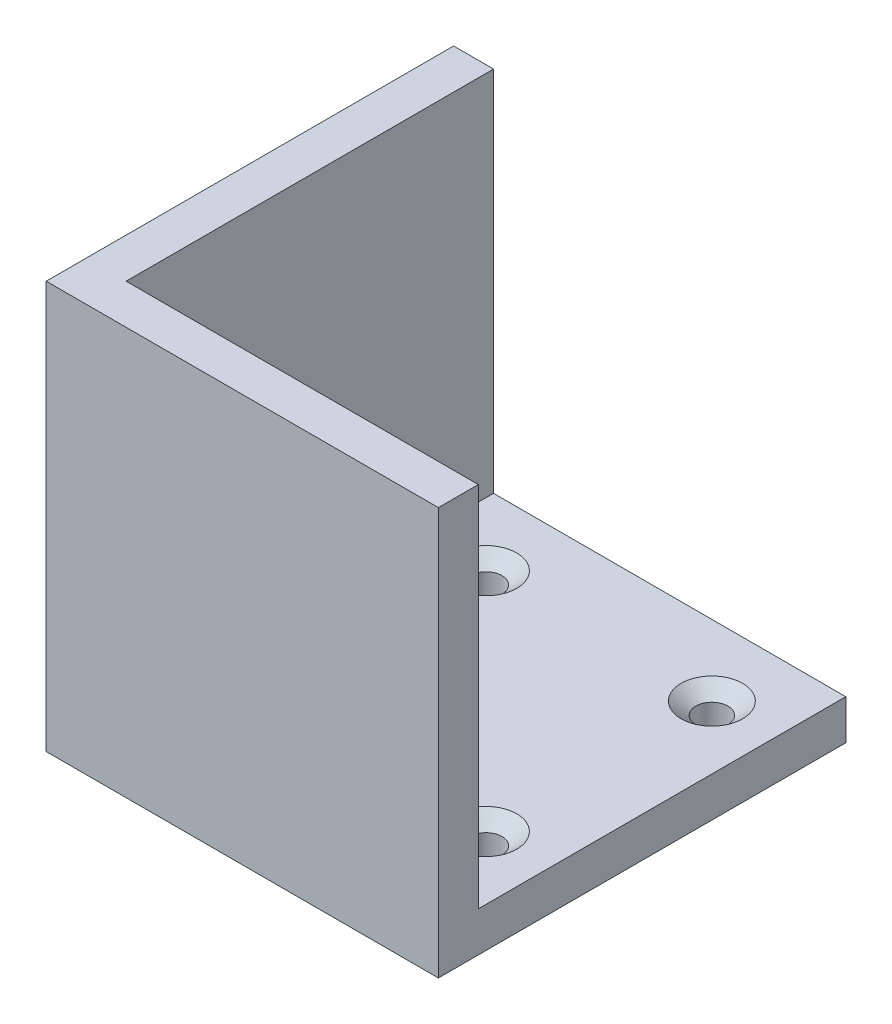
ISO-10303-21;
HEADER;
FILE_DESCRIPTION(('STEP AP214'),'2;1');
FILE_NAME('part.step','',(''),(''),'','','');
FILE_SCHEMA(('AUTOMOTIVE_DESIGN { 1 0 10303 214 1 1 1 1 }'));
ENDSEC;
DATA;
#1=APPLICATION_CONTEXT('core data for automotive mechanical design processes');
#2=APPLICATION_PROTOCOL_DEFINITION('international standard','automotive_design',2000,#1);
#3=PRODUCT_CONTEXT('',#1,'mechanical');
#4=PRODUCT('Part','Part','',(#3));
#5=PRODUCT_RELATED_PRODUCT_CATEGORY('part','',(#4));
#6=PRODUCT_DEFINITION_FORMATION('','',#4);
#7=PRODUCT_DEFINITION_CONTEXT('part definition',#1,'design');
#8=PRODUCT_DEFINITION('design','',#6,#7);
#9=PRODUCT_DEFINITION_SHAPE('','',#8);
#10=(LENGTH_UNIT() NAMED_UNIT(*) SI_UNIT(.MILLI.,.METRE.));
#11=(NAMED_UNIT(*) PLANE_ANGLE_UNIT() SI_UNIT($,.RADIAN.));
#12=(NAMED_UNIT(*) SI_UNIT($,.STERADIAN.) SOLID_ANGLE_UNIT());
#13=UNCERTAINTY_MEASURE_WITH_UNIT(LENGTH_MEASURE(1.E-05),#10,'distance_accuracy_value','');
#14=(GEOMETRIC_REPRESENTATION_CONTEXT(3) GLOBAL_UNCERTAINTY_ASSIGNED_CONTEXT((#13)) GLOBAL_UNIT_ASSIGNED_CONTEXT((#10,
#11,#12)) REPRESENTATION_CONTEXT('',''));
#15=CARTESIAN_POINT('',(0.,0.,0.));
#16=DIRECTION('',(0.,0.,1.));
#17=DIRECTION('',(1.,0.,0.));
#18=AXIS2_PLACEMENT_3D('',#15,#16,#17);
#19=CARTESIAN_POINT('',(28.,6.35,29.21));
#20=DIRECTION('',(-1.,0.,0.));
#21=DIRECTION('',(0.,0.,1.));
#22=AXIS2_PLACEMENT_3D('',#19,#20,#21);
#23=PLANE('',#22);
#24=DIRECTION('',(0.,0.,-1.));
#25=VECTOR('',#24,1.);
#26=CARTESIAN_POINT('',(28.,0.,29.21));
#27=LINE('',#26,#25);
#28=CARTESIAN_POINT('',(28.,0.,35.56));
#29=VERTEX_POINT('',#28);
#30=CARTESIAN_POINT('',(28.,0.,-29.21));
#31=VERTEX_POINT('',#30);
#32=EDGE_CURVE('E121',#29,#31,#27,.T.);
#33=ORIENTED_EDGE('',*,*,#32,.T.);
#34=DIRECTION('',(0.,-1.,0.));
#35=VECTOR('',#34,1.);
#36=CARTESIAN_POINT('',(28.,6.35,-29.21));
#37=LINE('',#36,#35);
#38=CARTESIAN_POINT('',(28.,6.35,-29.21));
#39=VERTEX_POINT('',#38);
#40=EDGE_CURVE('E11',#39,#31,#37,.T.);
#41=ORIENTED_EDGE('',*,*,#40,.F.);
#42=DIRECTION('',(0.,0.,-1.));
#43=VECTOR('',#42,1.);
#44=CARTESIAN_POINT('',(28.,6.35,29.21));
#45=LINE('',#44,#43);
#46=CARTESIAN_POINT('',(28.,6.35,29.21));
#47=VERTEX_POINT('',#46);
#48=EDGE_CURVE('E131',#47,#39,#45,.T.);
#49=ORIENTED_EDGE('',*,*,#48,.F.);
#50=DIRECTION('',(0.,-1.,0.));
#51=VECTOR('',#50,1.);
#52=CARTESIAN_POINT('',(28.,64.77,29.21));
#53=LINE('',#52,#51);
#54=CARTESIAN_POINT('',(28.,64.77,29.21));
#55=VERTEX_POINT('',#54);
#56=EDGE_CURVE('E153',#55,#47,#53,.T.);
#57=ORIENTED_EDGE('',*,*,#56,.F.);
#58=DIRECTION('',(0.,0.,-1.));
#59=VECTOR('',#58,1.);
#60=CARTESIAN_POINT('',(28.,64.77,29.21));
#61=LINE('',#60,#59);
#62=CARTESIAN_POINT('',(28.,64.77,35.56));
#63=VERTEX_POINT('',#62);
#64=EDGE_CURVE('E169',#63,#55,#61,.T.);
#65=ORIENTED_EDGE('',*,*,#64,.F.);
#66=DIRECTION('',(0.,-1.,0.));
#67=VECTOR('',#66,1.);
#68=CARTESIAN_POINT('',(28.,64.77,35.56));
#69=LINE('',#68,#67);
#70=EDGE_CURVE('E127',#63,#29,#69,.T.);
#71=ORIENTED_EDGE('',*,*,#70,.T.);
#72=EDGE_LOOP('',(#33,#41,#49,#57,#65,#71));
#73=FACE_BOUND('',#72,.T.);
#74=ADVANCED_FACE('F39',(#73),#23,.F.);
#75=CARTESIAN_POINT('',(-28.,6.35,-29.21));
#76=DIRECTION('',(0.,0.,1.));
#77=DIRECTION('',(1.,0.,0.));
#78=AXIS2_PLACEMENT_3D('',#75,#76,#77);
#79=PLANE('',#78);
#80=DIRECTION('',(-1.,0.,0.));
#81=VECTOR('',#80,1.);
#82=CARTESIAN_POINT('',(-28.,0.,-29.21));
#83=LINE('',#82,#81);
#84=CARTESIAN_POINT('',(-34.35,0.,-29.21));
#85=VERTEX_POINT('',#84);
#86=EDGE_CURVE('E118',#31,#85,#83,.T.);
#87=ORIENTED_EDGE('',*,*,#86,.T.);
#88=DIRECTION('',(0.,-1.,0.));
#89=VECTOR('',#88,1.);
#90=CARTESIAN_POINT('',(-34.35,64.77,-29.21));
#91=LINE('',#90,#89);
#92=CARTESIAN_POINT('',(-34.35,64.77,-29.21));
#93=VERTEX_POINT('',#92);
#94=EDGE_CURVE('E97',#93,#85,#91,.T.);
#95=ORIENTED_EDGE('',*,*,#94,.F.);
#96=DIRECTION('',(-1.,0.,0.));
#97=VECTOR('',#96,1.);
#98=CARTESIAN_POINT('',(-34.35,64.77,-29.21));
#99=LINE('',#98,#97);
#100=CARTESIAN_POINT('',(-28.,64.77,-29.21));
#101=VERTEX_POINT('',#100);
#102=EDGE_CURVE('E104',#101,#93,#99,.T.);
#103=ORIENTED_EDGE('',*,*,#102,.F.);
#104=DIRECTION('',(0.,-1.,0.));
#105=VECTOR('',#104,1.);
#106=CARTESIAN_POINT('',(-28.,64.77,-29.21));
#107=LINE('',#106,#105);
#108=CARTESIAN_POINT('',(-28.,6.35,-29.21));
#109=VERTEX_POINT('',#108);
#110=EDGE_CURVE('E156',#101,#109,#107,.T.);
#111=ORIENTED_EDGE('',*,*,#110,.T.);
#112=DIRECTION('',(-1.,0.,0.));
#113=VECTOR('',#112,1.);
#114=CARTESIAN_POINT('',(-28.,6.35,-29.21));
#115=LINE('',#114,#113);
#116=EDGE_CURVE('E134',#39,#109,#115,.T.);
#117=ORIENTED_EDGE('',*,*,#116,.F.);
#118=ORIENTED_EDGE('',*,*,#40,.T.);
#119=EDGE_LOOP('',(#87,#95,#103,#111,#117,#118));
#120=FACE_BOUND('',#119,.T.);
#121=ADVANCED_FACE('F116',(#120),#79,.F.);
#122=CARTESIAN_POINT('',(0.,6.35,0.));
#123=DIRECTION('',(0.,-1.,0.));
#124=DIRECTION('',(0.,0.,-1.));
#125=AXIS2_PLACEMENT_3D('',#122,#123,#124);
#126=PLANE('',#125);
#127=CARTESIAN_POINT('',(-17.9605122421383,6.35,-17.9605122421383));
#128=DIRECTION('',(0.,1.,0.));
#129=DIRECTION('',(0.,0.,1.));
#130=AXIS2_PLACEMENT_3D('',#127,#128,#129);
#131=CIRCLE('',#130,4.8895);
#132=CARTESIAN_POINT('',(-17.9605122421383,6.35,-13.0710122421383));
#133=VERTEX_POINT('',#132);
#134=EDGE_CURVE('E233',#133,#133,#131,.T.);
#135=ORIENTED_EDGE('',*,*,#134,.F.);
#136=EDGE_LOOP('',(#135));
#137=FACE_BOUND('',#136,.T.);
#138=CARTESIAN_POINT('',(-17.9605122421383,6.35,17.9605122421383));
#139=DIRECTION('',(0.,1.,0.));
#140=DIRECTION('',(0.,0.,1.));
#141=AXIS2_PLACEMENT_3D('',#138,#139,#140);
#142=CIRCLE('',#141,4.8895);
#143=CARTESIAN_POINT('',(-17.9605122421383,6.35,22.8500122421383));
#144=VERTEX_POINT('',#143);
#145=EDGE_CURVE('E221',#144,#144,#142,.T.);
#146=ORIENTED_EDGE('',*,*,#145,.F.);
#147=EDGE_LOOP('',(#146));
#148=FACE_BOUND('',#147,.T.);
#149=CARTESIAN_POINT('',(17.9605122421383,6.35,17.9605122421383));
#150=DIRECTION('',(0.,1.,0.));
#151=DIRECTION('',(0.,0.,1.));
#152=AXIS2_PLACEMENT_3D('',#149,#150,#151);
#153=CIRCLE('',#152,4.8895);
#154=CARTESIAN_POINT('',(17.9605122421383,6.35,22.8500122421383));
#155=VERTEX_POINT('',#154);
#156=EDGE_CURVE('E209',#155,#155,#153,.T.);
#157=ORIENTED_EDGE('',*,*,#156,.F.);
#158=EDGE_LOOP('',(#157));
#159=FACE_BOUND('',#158,.T.);
#160=CARTESIAN_POINT('',(17.9605122421383,6.35,-17.9605122421383));
#161=DIRECTION('',(0.,1.,0.));
#162=DIRECTION('',(0.,0.,1.));
#163=AXIS2_PLACEMENT_3D('',#160,#161,#162);
#164=CIRCLE('',#163,4.8895);
#165=CARTESIAN_POINT('',(17.9605122421383,6.35,-13.0710122421383));
#166=VERTEX_POINT('',#165);
#167=EDGE_CURVE('E197',#166,#166,#164,.T.);
#168=ORIENTED_EDGE('',*,*,#167,.F.);
#169=EDGE_LOOP('',(#168));
#170=FACE_BOUND('',#169,.T.);
#171=ORIENTED_EDGE('',*,*,#48,.T.);
#172=ORIENTED_EDGE('',*,*,#116,.T.);
#173=DIRECTION('',(0.,0.,1.));
#174=VECTOR('',#173,1.);
#175=CARTESIAN_POINT('',(-28.,6.35,29.21));
#176=LINE('',#175,#174);
#177=CARTESIAN_POINT('',(-28.,6.35,29.21));
#178=VERTEX_POINT('',#177);
#179=EDGE_CURVE('E137',#109,#178,#176,.T.);
#180=ORIENTED_EDGE('',*,*,#179,.T.);
#181=DIRECTION('',(1.,0.,0.));
#182=VECTOR('',#181,1.);
#183=CARTESIAN_POINT('',(-28.,6.35,29.21));
#184=LINE('',#183,#182);
#185=EDGE_CURVE('E48',#178,#47,#184,.T.);
#186=ORIENTED_EDGE('',*,*,#185,.T.);
#187=EDGE_LOOP('',(#171,#172,#180,#186));
#188=FACE_BOUND('',#187,.T.);
#189=ADVANCED_FACE('F143',(#137,#148,#159,#170,#188),#126,.F.);
#190=CARTESIAN_POINT('',(0.,0.,0.));
#191=DIRECTION('',(0.,-1.,0.));
#192=DIRECTION('',(0.,0.,-1.));
#193=AXIS2_PLACEMENT_3D('',#190,#191,#192);
#194=PLANE('',#193);
#195=CARTESIAN_POINT('',(-17.9605122421383,0.,-17.9605122421383));
#196=DIRECTION('',(0.,1.,0.));
#197=DIRECTION('',(0.,0.,1.));
#198=AXIS2_PLACEMENT_3D('',#195,#196,#197);
#199=CIRCLE('',#198,2.5527);
#200=CARTESIAN_POINT('',(-17.9605122421383,0.,-15.4078122421383));
#201=VERTEX_POINT('',#200);
#202=EDGE_CURVE('E225',#201,#201,#199,.T.);
#203=ORIENTED_EDGE('',*,*,#202,.T.);
#204=EDGE_LOOP('',(#203));
#205=FACE_BOUND('',#204,.T.);
#206=CARTESIAN_POINT('',(-17.9605122421383,0.,17.9605122421383));
#207=DIRECTION('',(0.,1.,0.));
#208=DIRECTION('',(0.,0.,1.));
#209=AXIS2_PLACEMENT_3D('',#206,#207,#208);
#210=CIRCLE('',#209,2.5527);
#211=CARTESIAN_POINT('',(-17.9605122421383,0.,20.5132122421383));
#212=VERTEX_POINT('',#211);
#213=EDGE_CURVE('E213',#212,#212,#210,.T.);
#214=ORIENTED_EDGE('',*,*,#213,.T.);
#215=EDGE_LOOP('',(#214));
#216=FACE_BOUND('',#215,.T.);
#217=CARTESIAN_POINT('',(17.9605122421383,0.,17.9605122421383));
#218=DIRECTION('',(0.,1.,0.));
#219=DIRECTION('',(0.,0.,1.));
#220=AXIS2_PLACEMENT_3D('',#217,#218,#219);
#221=CIRCLE('',#220,2.5527);
#222=CARTESIAN_POINT('',(17.9605122421383,0.,20.5132122421383));
#223=VERTEX_POINT('',#222);
#224=EDGE_CURVE('E201',#223,#223,#221,.T.);
#225=ORIENTED_EDGE('',*,*,#224,.T.);
#226=EDGE_LOOP('',(#225));
#227=FACE_BOUND('',#226,.T.);
#228=CARTESIAN_POINT('',(17.9605122421383,0.,-17.9605122421383));
#229=DIRECTION('',(0.,1.,0.));
#230=DIRECTION('',(0.,0.,1.));
#231=AXIS2_PLACEMENT_3D('',#228,#229,#230);
#232=CIRCLE('',#231,2.5527);
#233=CARTESIAN_POINT('',(17.9605122421383,0.,-15.4078122421383));
#234=VERTEX_POINT('',#233);
#235=EDGE_CURVE('E178',#234,#234,#232,.T.);
#236=ORIENTED_EDGE('',*,*,#235,.T.);
#237=EDGE_LOOP('',(#236));
#238=FACE_BOUND('',#237,.T.);
#239=ORIENTED_EDGE('',*,*,#32,.F.);
#240=DIRECTION('',(1.,0.,0.));
#241=VECTOR('',#240,1.);
#242=CARTESIAN_POINT('',(-34.35,0.,35.56));
#243=LINE('',#242,#241);
#244=CARTESIAN_POINT('',(-34.35,0.,35.56));
#245=VERTEX_POINT('',#244);
#246=EDGE_CURVE('E114',#245,#29,#243,.T.);
#247=ORIENTED_EDGE('',*,*,#246,.F.);
#248=DIRECTION('',(0.,0.,1.));
#249=VECTOR('',#248,1.);
#250=CARTESIAN_POINT('',(-34.35,0.,-29.21));
#251=LINE('',#250,#249);
#252=EDGE_CURVE('E176',#85,#245,#251,.T.);
#253=ORIENTED_EDGE('',*,*,#252,.F.);
#254=ORIENTED_EDGE('',*,*,#86,.F.);
#255=EDGE_LOOP('',(#239,#247,#253,#254));
#256=FACE_BOUND('',#255,.T.);
#257=ADVANCED_FACE('F242',(#205,#216,#227,#238,#256),#194,.T.);
#258=CARTESIAN_POINT('',(-28.,64.77,29.21));
#259=DIRECTION('',(0.,0.,1.));
#260=DIRECTION('',(1.,0.,0.));
#261=AXIS2_PLACEMENT_3D('',#258,#259,#260);
#262=PLANE('',#261);
#263=ORIENTED_EDGE('',*,*,#56,.T.);
#264=ORIENTED_EDGE('',*,*,#185,.F.);
#265=DIRECTION('',(0.,-1.,0.));
#266=VECTOR('',#265,1.);
#267=CARTESIAN_POINT('',(-28.,64.77,29.21));
#268=LINE('',#267,#266);
#269=CARTESIAN_POINT('',(-28.,64.77,29.21));
#270=VERTEX_POINT('',#269);
#271=EDGE_CURVE('E151',#270,#178,#268,.T.);
#272=ORIENTED_EDGE('',*,*,#271,.F.);
#273=DIRECTION('',(-1.,0.,0.));
#274=VECTOR('',#273,1.);
#275=CARTESIAN_POINT('',(-28.,64.77,29.21));
#276=LINE('',#275,#274);
#277=EDGE_CURVE('E183',#55,#270,#276,.T.);
#278=ORIENTED_EDGE('',*,*,#277,.F.);
#279=EDGE_LOOP('',(#263,#264,#272,#278));
#280=FACE_BOUND('',#279,.T.);
#281=ADVANCED_FACE('F149',(#280),#262,.F.);
#282=CARTESIAN_POINT('',(-28.,64.77,-29.21));
#283=DIRECTION('',(-1.,0.,0.));
#284=DIRECTION('',(0.,0.,1.));
#285=AXIS2_PLACEMENT_3D('',#282,#283,#284);
#286=PLANE('',#285);
#287=ORIENTED_EDGE('',*,*,#271,.T.);
#288=ORIENTED_EDGE('',*,*,#179,.F.);
#289=ORIENTED_EDGE('',*,*,#110,.F.);
#290=DIRECTION('',(0.,0.,-1.));
#291=VECTOR('',#290,1.);
#292=CARTESIAN_POINT('',(-28.,64.77,-29.21));
#293=LINE('',#292,#291);
#294=EDGE_CURVE('E109',#270,#101,#293,.T.);
#295=ORIENTED_EDGE('',*,*,#294,.F.);
#296=EDGE_LOOP('',(#287,#288,#289,#295));
#297=FACE_BOUND('',#296,.T.);
#298=ADVANCED_FACE('F154',(#297),#286,.F.);
#299=CARTESIAN_POINT('',(-34.35,64.77,-29.21));
#300=DIRECTION('',(1.,0.,0.));
#301=DIRECTION('',(0.,0.,-1.));
#302=AXIS2_PLACEMENT_3D('',#299,#300,#301);
#303=PLANE('',#302);
#304=ORIENTED_EDGE('',*,*,#252,.T.);
#305=DIRECTION('',(0.,-1.,0.));
#306=VECTOR('',#305,1.);
#307=CARTESIAN_POINT('',(-34.35,64.77,35.56));
#308=LINE('',#307,#306);
#309=CARTESIAN_POINT('',(-34.35,64.77,35.56));
#310=VERTEX_POINT('',#309);
#311=EDGE_CURVE('E99',#310,#245,#308,.T.);
#312=ORIENTED_EDGE('',*,*,#311,.F.);
#313=DIRECTION('',(0.,0.,1.));
#314=VECTOR('',#313,1.);
#315=CARTESIAN_POINT('',(-34.35,64.77,-29.21));
#316=LINE('',#315,#314);
#317=EDGE_CURVE('E93',#93,#310,#316,.T.);
#318=ORIENTED_EDGE('',*,*,#317,.F.);
#319=ORIENTED_EDGE('',*,*,#94,.T.);
#320=EDGE_LOOP('',(#304,#312,#318,#319));
#321=FACE_BOUND('',#320,.T.);
#322=ADVANCED_FACE('F95',(#321),#303,.F.);
#323=CARTESIAN_POINT('',(-34.35,64.77,35.56));
#324=DIRECTION('',(0.,0.,-1.));
#325=DIRECTION('',(-1.,0.,0.));
#326=AXIS2_PLACEMENT_3D('',#323,#324,#325);
#327=PLANE('',#326);
#328=ORIENTED_EDGE('',*,*,#246,.T.);
#329=ORIENTED_EDGE('',*,*,#70,.F.);
#330=DIRECTION('',(1.,0.,0.));
#331=VECTOR('',#330,1.);
#332=CARTESIAN_POINT('',(-34.35,64.77,35.56));
#333=LINE('',#332,#331);
#334=EDGE_CURVE('E103',#310,#63,#333,.T.);
#335=ORIENTED_EDGE('',*,*,#334,.F.);
#336=ORIENTED_EDGE('',*,*,#311,.T.);
#337=EDGE_LOOP('',(#328,#329,#335,#336));
#338=FACE_BOUND('',#337,.T.);
#339=ADVANCED_FACE('F172',(#338),#327,.F.);
#340=CARTESIAN_POINT('',(0.,64.77,0.));
#341=DIRECTION('',(0.,-1.,0.));
#342=DIRECTION('',(0.,0.,-1.));
#343=AXIS2_PLACEMENT_3D('',#340,#341,#342);
#344=PLANE('',#343);
#345=ORIENTED_EDGE('',*,*,#102,.T.);
#346=ORIENTED_EDGE('',*,*,#317,.T.);
#347=ORIENTED_EDGE('',*,*,#334,.T.);
#348=ORIENTED_EDGE('',*,*,#64,.T.);
#349=ORIENTED_EDGE('',*,*,#277,.T.);
#350=ORIENTED_EDGE('',*,*,#294,.T.);
#351=EDGE_LOOP('',(#345,#346,#347,#348,#349,#350));
#352=FACE_BOUND('',#351,.T.);
#353=ADVANCED_FACE('F107',(#352),#344,.F.);
#354=CARTESIAN_POINT('',(17.9605122421383,6.35,-17.9605122421383));
#355=DIRECTION('',(0.,1.,0.));
#356=DIRECTION('',(0.,0.,1.));
#357=AXIS2_PLACEMENT_3D('',#354,#355,#356);
#358=CYLINDRICAL_SURFACE('',#357,2.5527);
#359=ORIENTED_EDGE('',*,*,#235,.F.);
#360=EDGE_LOOP('',(#359));
#361=FACE_BOUND('',#360,.T.);
#362=CARTESIAN_POINT('',(17.9605122421383,4.38919198186493,-17.9605122421383));
#363=DIRECTION('',(0.,1.,0.));
#364=DIRECTION('',(0.,0.,1.));
#365=AXIS2_PLACEMENT_3D('',#362,#363,#364);
#366=CIRCLE('',#365,2.5527);
#367=CARTESIAN_POINT('',(17.9605122421383,4.38919198186493,-15.4078122421383));
#368=VERTEX_POINT('',#367);
#369=EDGE_CURVE('E193',#368,#368,#366,.T.);
#370=ORIENTED_EDGE('',*,*,#369,.T.);
#371=EDGE_LOOP('',(#370));
#372=FACE_BOUND('',#371,.T.);
#373=ADVANCED_FACE('F253',(#361,#372),#358,.F.);
#374=CARTESIAN_POINT('',(17.9605122421383,6.35,-17.9605122421383));
#375=DIRECTION('',(0.,1.,0.));
#376=DIRECTION('',(0.,0.,1.));
#377=AXIS2_PLACEMENT_3D('',#374,#375,#376);
#378=CONICAL_SURFACE('',#377,4.8895,0.872664625997164);
#379=ORIENTED_EDGE('',*,*,#369,.F.);
#380=EDGE_LOOP('',(#379));
#381=FACE_BOUND('',#380,.T.);
#382=ORIENTED_EDGE('',*,*,#167,.T.);
#383=EDGE_LOOP('',(#382));
#384=FACE_BOUND('',#383,.T.);
#385=ADVANCED_FACE('F250',(#381,#384),#378,.F.);
#386=CARTESIAN_POINT('',(17.9605122421383,6.35,17.9605122421383));
#387=DIRECTION('',(0.,1.,0.));
#388=DIRECTION('',(0.,0.,1.));
#389=AXIS2_PLACEMENT_3D('',#386,#387,#388);
#390=CYLINDRICAL_SURFACE('',#389,2.5527);
#391=ORIENTED_EDGE('',*,*,#224,.F.);
#392=EDGE_LOOP('',(#391));
#393=FACE_BOUND('',#392,.T.);
#394=CARTESIAN_POINT('',(17.9605122421383,4.38919198186493,17.9605122421383));
#395=DIRECTION('',(0.,1.,0.));
#396=DIRECTION('',(0.,0.,1.));
#397=AXIS2_PLACEMENT_3D('',#394,#395,#396);
#398=CIRCLE('',#397,2.5527);
#399=CARTESIAN_POINT('',(17.9605122421383,4.38919198186493,20.5132122421383));
#400=VERTEX_POINT('',#399);
#401=EDGE_CURVE('E205',#400,#400,#398,.T.);
#402=ORIENTED_EDGE('',*,*,#401,.T.);
#403=EDGE_LOOP('',(#402));
#404=FACE_BOUND('',#403,.T.);
#405=ADVANCED_FACE('F252',(#393,#404),#390,.F.);
#406=CARTESIAN_POINT('',(17.9605122421383,6.35,17.9605122421383));
#407=DIRECTION('',(0.,1.,0.));
#408=DIRECTION('',(0.,0.,1.));
#409=AXIS2_PLACEMENT_3D('',#406,#407,#408);
#410=CONICAL_SURFACE('',#409,4.8895,0.872664625997164);
#411=ORIENTED_EDGE('',*,*,#401,.F.);
#412=EDGE_LOOP('',(#411));
#413=FACE_BOUND('',#412,.T.);
#414=ORIENTED_EDGE('',*,*,#156,.T.);
#415=EDGE_LOOP('',(#414));
#416=FACE_BOUND('',#415,.T.);
#417=ADVANCED_FACE('F260',(#413,#416),#410,.F.);
#418=CARTESIAN_POINT('',(-17.9605122421383,6.35,17.9605122421383));
#419=DIRECTION('',(0.,1.,0.));
#420=DIRECTION('',(0.,0.,1.));
#421=AXIS2_PLACEMENT_3D('',#418,#419,#420);
#422=CYLINDRICAL_SURFACE('',#421,2.5527);
#423=ORIENTED_EDGE('',*,*,#213,.F.);
#424=EDGE_LOOP('',(#423));
#425=FACE_BOUND('',#424,.T.);
#426=CARTESIAN_POINT('',(-17.9605122421383,4.38919198186493,17.9605122421383));
#427=DIRECTION('',(0.,1.,0.));
#428=DIRECTION('',(0.,0.,1.));
#429=AXIS2_PLACEMENT_3D('',#426,#427,#428);
#430=CIRCLE('',#429,2.5527);
#431=CARTESIAN_POINT('',(-17.9605122421383,4.38919198186493,20.5132122421383));
#432=VERTEX_POINT('',#431);
#433=EDGE_CURVE('E217',#432,#432,#430,.T.);
#434=ORIENTED_EDGE('',*,*,#433,.T.);
#435=EDGE_LOOP('',(#434));
#436=FACE_BOUND('',#435,.T.);
#437=ADVANCED_FACE('F316',(#425,#436),#422,.F.);
#438=CARTESIAN_POINT('',(-17.9605122421383,6.35,17.9605122421383));
#439=DIRECTION('',(0.,1.,0.));
#440=DIRECTION('',(0.,0.,1.));
#441=AXIS2_PLACEMENT_3D('',#438,#439,#440);
#442=CONICAL_SURFACE('',#441,4.8895,0.872664625997164);
#443=ORIENTED_EDGE('',*,*,#433,.F.);
#444=EDGE_LOOP('',(#443));
#445=FACE_BOUND('',#444,.T.);
#446=ORIENTED_EDGE('',*,*,#145,.T.);
#447=EDGE_LOOP('',(#446));
#448=FACE_BOUND('',#447,.T.);
#449=ADVANCED_FACE('F326',(#445,#448),#442,.F.);
#450=CARTESIAN_POINT('',(-17.9605122421383,6.35,-17.9605122421383));
#451=DIRECTION('',(0.,1.,0.));
#452=DIRECTION('',(0.,0.,1.));
#453=AXIS2_PLACEMENT_3D('',#450,#451,#452);
#454=CYLINDRICAL_SURFACE('',#453,2.5527);
#455=ORIENTED_EDGE('',*,*,#202,.F.);
#456=EDGE_LOOP('',(#455));
#457=FACE_BOUND('',#456,.T.);
#458=CARTESIAN_POINT('',(-17.9605122421383,4.38919198186493,-17.9605122421383));
#459=DIRECTION('',(0.,1.,0.));
#460=DIRECTION('',(0.,0.,1.));
#461=AXIS2_PLACEMENT_3D('',#458,#459,#460);
#462=CIRCLE('',#461,2.5527);
#463=CARTESIAN_POINT('',(-17.9605122421383,4.38919198186493,-15.4078122421383));
#464=VERTEX_POINT('',#463);
#465=EDGE_CURVE('E229',#464,#464,#462,.T.);
#466=ORIENTED_EDGE('',*,*,#465,.T.);
#467=EDGE_LOOP('',(#466));
#468=FACE_BOUND('',#467,.T.);
#469=ADVANCED_FACE('F336',(#457,#468),#454,.F.);
#470=CARTESIAN_POINT('',(-17.9605122421383,6.35,-17.9605122421383));
#471=DIRECTION('',(0.,1.,0.));
#472=DIRECTION('',(0.,0.,1.));
#473=AXIS2_PLACEMENT_3D('',#470,#471,#472);
#474=CONICAL_SURFACE('',#473,4.8895,0.872664625997164);
#475=ORIENTED_EDGE('',*,*,#465,.F.);
#476=EDGE_LOOP('',(#475));
#477=FACE_BOUND('',#476,.T.);
#478=ORIENTED_EDGE('',*,*,#134,.T.);
#479=EDGE_LOOP('',(#478));
#480=FACE_BOUND('',#479,.T.);
#481=ADVANCED_FACE('F238',(#477,#480),#474,.F.);
#482=CLOSED_SHELL('',(#74,#121,#189,#257,#281,#298,#322,#339,#353,#373,#385,#405,#417,#437,#449,
#469,#481));
#483=MANIFOLD_SOLID_BREP('B2',#482);
#484=ADVANCED_BREP_SHAPE_REPRESENTATION('',(#18,#483),#14);
#485=SHAPE_DEFINITION_REPRESENTATION(#9,#484);
ENDSEC;
END-ISO-10303-21;
